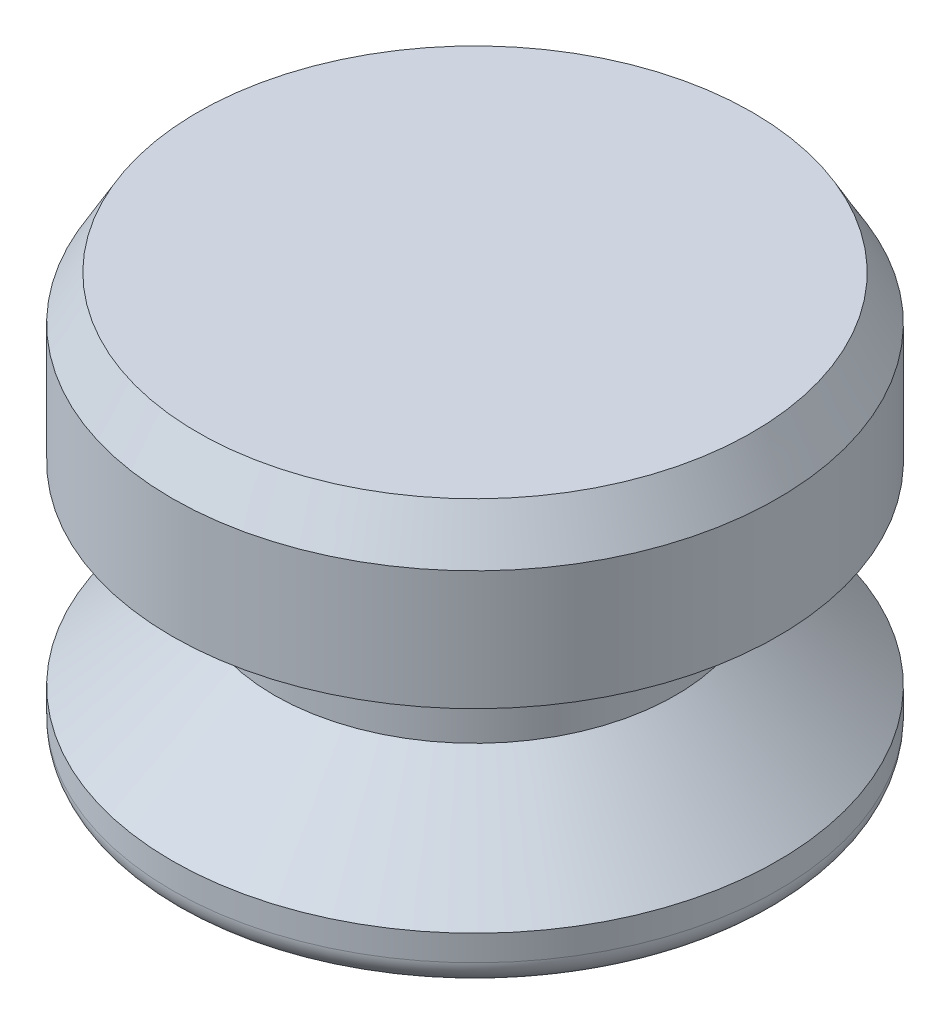
ISO-10303-21;
HEADER;
FILE_DESCRIPTION(('STEP AP214'),'2;1');
FILE_NAME('part.step','',(''),(''),'','','');
FILE_SCHEMA(('AUTOMOTIVE_DESIGN { 1 0 10303 214 1 1 1 1 }'));
ENDSEC;
DATA;
#1=APPLICATION_CONTEXT('core data for automotive mechanical design processes');
#2=APPLICATION_PROTOCOL_DEFINITION('international standard','automotive_design',2000,#1);
#3=PRODUCT_CONTEXT('',#1,'mechanical');
#4=PRODUCT('Part','Part','',(#3));
#5=PRODUCT_RELATED_PRODUCT_CATEGORY('part','',(#4));
#6=PRODUCT_DEFINITION_FORMATION('','',#4);
#7=PRODUCT_DEFINITION_CONTEXT('part definition',#1,'design');
#8=PRODUCT_DEFINITION('design','',#6,#7);
#9=PRODUCT_DEFINITION_SHAPE('','',#8);
#10=(LENGTH_UNIT() NAMED_UNIT(*) SI_UNIT(.MILLI.,.METRE.));
#11=(NAMED_UNIT(*) PLANE_ANGLE_UNIT() SI_UNIT($,.RADIAN.));
#12=(NAMED_UNIT(*) SI_UNIT($,.STERADIAN.) SOLID_ANGLE_UNIT());
#13=UNCERTAINTY_MEASURE_WITH_UNIT(LENGTH_MEASURE(1.E-05),#10,'distance_accuracy_value','');
#14=(GEOMETRIC_REPRESENTATION_CONTEXT(3) GLOBAL_UNCERTAINTY_ASSIGNED_CONTEXT((#13)) GLOBAL_UNIT_ASSIGNED_CONTEXT((#10,
#11,#12)) REPRESENTATION_CONTEXT('',''));
#15=CARTESIAN_POINT('',(0.,0.,0.));
#16=DIRECTION('',(0.,0.,1.));
#17=DIRECTION('',(1.,0.,0.));
#18=AXIS2_PLACEMENT_3D('',#15,#16,#17);
#19=CARTESIAN_POINT('',(0.,0.,0.));
#20=DIRECTION('',(0.,1.,0.));
#21=DIRECTION('',(0.,0.,1.));
#22=AXIS2_PLACEMENT_3D('',#19,#20,#21);
#23=PLANE('',#22);
#24=CARTESIAN_POINT('',(0.,0.,0.));
#25=DIRECTION('',(0.,1.,0.));
#26=DIRECTION('',(0.,0.,1.));
#27=AXIS2_PLACEMENT_3D('',#24,#25,#26);
#28=CIRCLE('',#27,8.60425);
#29=CARTESIAN_POINT('',(0.,0.,8.60425));
#30=VERTEX_POINT('',#29);
#31=EDGE_CURVE('E46',#30,#30,#28,.F.);
#32=ORIENTED_EDGE('',*,*,#31,.T.);
#33=EDGE_LOOP('',(#32));
#34=FACE_BOUND('',#33,.T.);
#35=ADVANCED_FACE('F31',(#34),#23,.F.);
#36=CARTESIAN_POINT('',(0.,0.,0.));
#37=DIRECTION('',(0.,-1.,0.));
#38=DIRECTION('',(0.,0.,-1.));
#39=AXIS2_PLACEMENT_3D('',#36,#37,#38);
#40=CYLINDRICAL_SURFACE('',#39,9.398);
#41=CARTESIAN_POINT('',(0.,0.793749999999999,0.));
#42=DIRECTION('',(0.,1.,0.));
#43=DIRECTION('',(0.,0.,1.));
#44=AXIS2_PLACEMENT_3D('',#41,#42,#43);
#45=CIRCLE('',#44,9.398);
#46=CARTESIAN_POINT('',(0.,0.793749999999999,9.398));
#47=VERTEX_POINT('',#46);
#48=EDGE_CURVE('E42',#47,#47,#45,.T.);
#49=ORIENTED_EDGE('',*,*,#48,.T.);
#50=EDGE_LOOP('',(#49));
#51=FACE_BOUND('',#50,.T.);
#52=CARTESIAN_POINT('',(0.,1.5875,0.));
#53=DIRECTION('',(0.,-1.,0.));
#54=DIRECTION('',(0.,0.,-1.));
#55=AXIS2_PLACEMENT_3D('',#52,#53,#54);
#56=CIRCLE('',#55,9.398);
#57=CARTESIAN_POINT('',(0.,1.5875,-9.398));
#58=VERTEX_POINT('',#57);
#59=EDGE_CURVE('E51',#58,#58,#56,.T.);
#60=ORIENTED_EDGE('',*,*,#59,.T.);
#61=EDGE_LOOP('',(#60));
#62=FACE_BOUND('',#61,.T.);
#63=ADVANCED_FACE('F80',(#51,#62),#40,.T.);
#64=CARTESIAN_POINT('',(0.,4.445,0.));
#65=DIRECTION('',(0.,-1.,0.));
#66=DIRECTION('',(0.,0.,-1.));
#67=AXIS2_PLACEMENT_3D('',#64,#65,#66);
#68=CONICAL_SURFACE('',#67,6.223,0.83798122500839);
#69=ORIENTED_EDGE('',*,*,#59,.F.);
#70=EDGE_LOOP('',(#69));
#71=FACE_BOUND('',#70,.T.);
#72=CARTESIAN_POINT('',(0.,4.445,0.));
#73=DIRECTION('',(0.,-1.,0.));
#74=DIRECTION('',(0.,0.,-1.));
#75=AXIS2_PLACEMENT_3D('',#72,#73,#74);
#76=CIRCLE('',#75,6.223);
#77=CARTESIAN_POINT('',(0.,4.445,-6.223));
#78=VERTEX_POINT('',#77);
#79=EDGE_CURVE('E54',#78,#78,#76,.T.);
#80=ORIENTED_EDGE('',*,*,#79,.T.);
#81=EDGE_LOOP('',(#80));
#82=FACE_BOUND('',#81,.T.);
#83=ADVANCED_FACE('F86',(#71,#82),#68,.T.);
#84=CARTESIAN_POINT('',(0.,0.,0.));
#85=DIRECTION('',(0.,-1.,0.));
#86=DIRECTION('',(0.,0.,-1.));
#87=AXIS2_PLACEMENT_3D('',#84,#85,#86);
#88=CYLINDRICAL_SURFACE('',#87,6.223);
#89=ORIENTED_EDGE('',*,*,#79,.F.);
#90=EDGE_LOOP('',(#89));
#91=FACE_BOUND('',#90,.T.);
#92=CARTESIAN_POINT('',(0.,7.62,0.));
#93=DIRECTION('',(0.,-1.,0.));
#94=DIRECTION('',(0.,0.,-1.));
#95=AXIS2_PLACEMENT_3D('',#92,#93,#94);
#96=CIRCLE('',#95,6.223);
#97=CARTESIAN_POINT('',(0.,7.62,-6.223));
#98=VERTEX_POINT('',#97);
#99=EDGE_CURVE('E57',#98,#98,#96,.T.);
#100=ORIENTED_EDGE('',*,*,#99,.T.);
#101=EDGE_LOOP('',(#100));
#102=FACE_BOUND('',#101,.T.);
#103=ADVANCED_FACE('F76',(#91,#102),#88,.T.);
#104=CARTESIAN_POINT('',(-6.223,7.62,0.));
#105=DIRECTION('',(0.,1.,0.));
#106=DIRECTION('',(0.,0.,1.));
#107=AXIS2_PLACEMENT_3D('',#104,#105,#106);
#108=PLANE('',#107);
#109=ORIENTED_EDGE('',*,*,#99,.F.);
#110=EDGE_LOOP('',(#109));
#111=FACE_BOUND('',#110,.T.);
#112=CARTESIAN_POINT('',(0.,7.62,0.));
#113=DIRECTION('',(0.,-1.,0.));
#114=DIRECTION('',(0.,0.,-1.));
#115=AXIS2_PLACEMENT_3D('',#112,#113,#114);
#116=CIRCLE('',#115,9.398);
#117=CARTESIAN_POINT('',(0.,7.62,-9.398));
#118=VERTEX_POINT('',#117);
#119=EDGE_CURVE('E60',#118,#118,#116,.T.);
#120=ORIENTED_EDGE('',*,*,#119,.T.);
#121=EDGE_LOOP('',(#120));
#122=FACE_BOUND('',#121,.T.);
#123=ADVANCED_FACE('F64',(#111,#122),#108,.F.);
#124=CARTESIAN_POINT('',(0.,0.,0.));
#125=DIRECTION('',(0.,-1.,0.));
#126=DIRECTION('',(0.,0.,-1.));
#127=AXIS2_PLACEMENT_3D('',#124,#125,#126);
#128=CYLINDRICAL_SURFACE('',#127,9.398);
#129=CARTESIAN_POINT('',(0.,11.3251846714922,0.));
#130=DIRECTION('',(0.,-1.,0.));
#131=DIRECTION('',(0.,0.,-1.));
#132=AXIS2_PLACEMENT_3D('',#129,#130,#131);
#133=CIRCLE('',#132,9.398);
#134=CARTESIAN_POINT('',(0.,11.3251846714922,-9.398));
#135=VERTEX_POINT('',#134);
#136=EDGE_CURVE('E38',#135,#135,#133,.T.);
#137=ORIENTED_EDGE('',*,*,#136,.T.);
#138=EDGE_LOOP('',(#137));
#139=FACE_BOUND('',#138,.T.);
#140=ORIENTED_EDGE('',*,*,#119,.F.);
#141=EDGE_LOOP('',(#140));
#142=FACE_BOUND('',#141,.T.);
#143=ADVANCED_FACE('F66',(#139,#142),#128,.T.);
#144=CARTESIAN_POINT('',(-9.398,12.7,0.));
#145=DIRECTION('',(0.,-1.,0.));
#146=DIRECTION('',(0.,0.,-1.));
#147=AXIS2_PLACEMENT_3D('',#144,#145,#146);
#148=PLANE('',#147);
#149=CARTESIAN_POINT('',(0.,12.7,0.));
#150=DIRECTION('',(0.,-1.,0.));
#151=DIRECTION('',(0.,0.,-1.));
#152=AXIS2_PLACEMENT_3D('',#149,#150,#151);
#153=CIRCLE('',#152,8.60424999999999);
#154=CARTESIAN_POINT('',(0.,12.7,-8.60424999999999));
#155=VERTEX_POINT('',#154);
#156=EDGE_CURVE('E10',#155,#155,#153,.F.);
#157=ORIENTED_EDGE('',*,*,#156,.T.);
#158=EDGE_LOOP('',(#157));
#159=FACE_BOUND('',#158,.T.);
#160=ADVANCED_FACE('F68',(#159),#148,.F.);
#161=CARTESIAN_POINT('',(0.,0.793749999999999,0.));
#162=DIRECTION('',(0.,1.,0.));
#163=DIRECTION('',(0.,0.,1.));
#164=AXIS2_PLACEMENT_3D('',#161,#162,#163);
#165=TOROIDAL_SURFACE('',#164,8.60425,0.79375);
#166=ORIENTED_EDGE('',*,*,#48,.F.);
#167=EDGE_LOOP('',(#166));
#168=FACE_BOUND('',#167,.T.);
#169=ORIENTED_EDGE('',*,*,#31,.F.);
#170=EDGE_LOOP('',(#169));
#171=FACE_BOUND('',#170,.T.);
#172=ADVANCED_FACE('F74',(#168,#171),#165,.T.);
#173=CARTESIAN_POINT('',(0.,11.3251846714922,0.));
#174=DIRECTION('',(0.,-1.,0.));
#175=DIRECTION('',(0.,0.,-1.));
#176=AXIS2_PLACEMENT_3D('',#173,#174,#175);
#177=CONICAL_SURFACE('',#176,9.398,0.5235987755983);
#178=ORIENTED_EDGE('',*,*,#156,.F.);
#179=EDGE_LOOP('',(#178));
#180=FACE_BOUND('',#179,.T.);
#181=ORIENTED_EDGE('',*,*,#136,.F.);
#182=EDGE_LOOP('',(#181));
#183=FACE_BOUND('',#182,.T.);
#184=ADVANCED_FACE('F33',(#180,#183),#177,.T.);
#185=CLOSED_SHELL('',(#35,#63,#83,#103,#123,#143,#160,#172,#184));
#186=MANIFOLD_SOLID_BREP('B2',#185);
#187=ADVANCED_BREP_SHAPE_REPRESENTATION('',(#18,#186),#14);
#188=SHAPE_DEFINITION_REPRESENTATION(#9,#187);
ENDSEC;
END-ISO-10303-21;
